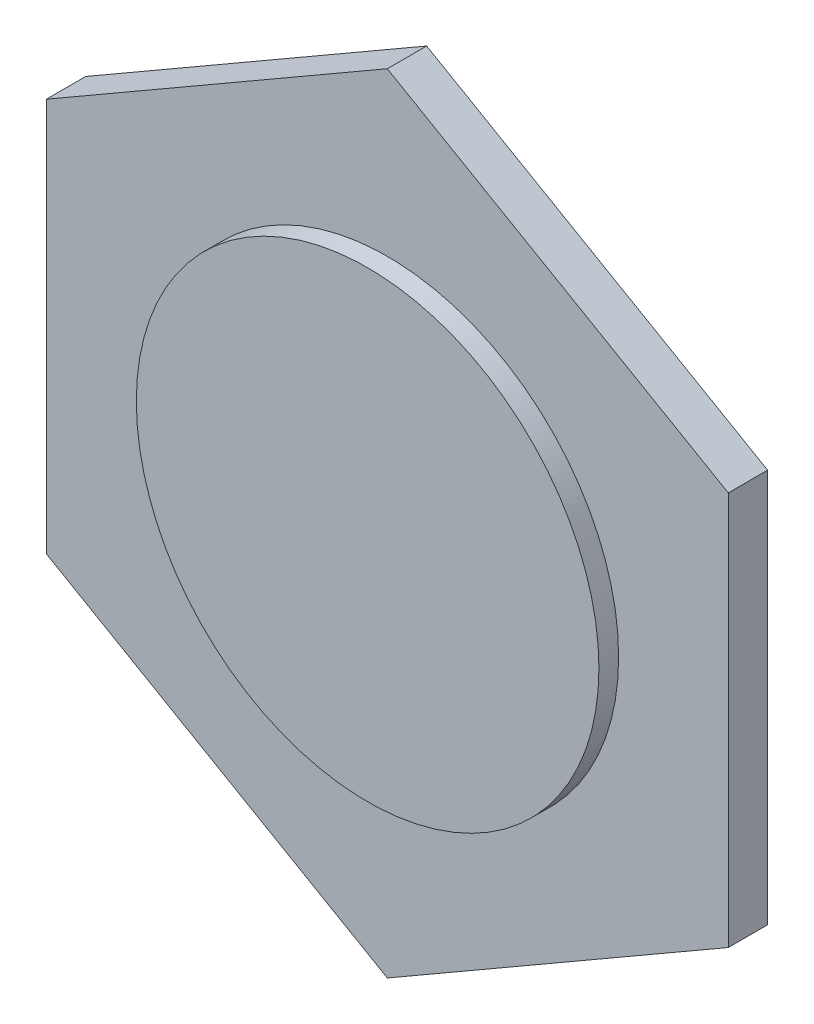
ISO-10303-21;
HEADER;
FILE_DESCRIPTION(('STEP AP214'),'2;1');
FILE_NAME('part.step','',(''),(''),'','','');
FILE_SCHEMA(('AUTOMOTIVE_DESIGN { 1 0 10303 214 1 1 1 1 }'));
ENDSEC;
DATA;
#1=APPLICATION_CONTEXT('core data for automotive mechanical design processes');
#2=APPLICATION_PROTOCOL_DEFINITION('international standard','automotive_design',2000,#1);
#3=PRODUCT_CONTEXT('',#1,'mechanical');
#4=PRODUCT('Part','Part','',(#3));
#5=PRODUCT_RELATED_PRODUCT_CATEGORY('part','',(#4));
#6=PRODUCT_DEFINITION_FORMATION('','',#4);
#7=PRODUCT_DEFINITION_CONTEXT('part definition',#1,'design');
#8=PRODUCT_DEFINITION('design','',#6,#7);
#9=PRODUCT_DEFINITION_SHAPE('','',#8);
#10=(LENGTH_UNIT() NAMED_UNIT(*) SI_UNIT(.MILLI.,.METRE.));
#11=(NAMED_UNIT(*) PLANE_ANGLE_UNIT() SI_UNIT($,.RADIAN.));
#12=(NAMED_UNIT(*) SI_UNIT($,.STERADIAN.) SOLID_ANGLE_UNIT());
#13=UNCERTAINTY_MEASURE_WITH_UNIT(LENGTH_MEASURE(1.E-05),#10,'distance_accuracy_value','');
#14=(GEOMETRIC_REPRESENTATION_CONTEXT(3) GLOBAL_UNCERTAINTY_ASSIGNED_CONTEXT((#13)) GLOBAL_UNIT_ASSIGNED_CONTEXT((#10,
#11,#12)) REPRESENTATION_CONTEXT('',''));
#15=CARTESIAN_POINT('',(0.,0.,0.));
#16=DIRECTION('',(0.,0.,1.));
#17=DIRECTION('',(1.,0.,0.));
#18=AXIS2_PLACEMENT_3D('',#15,#16,#17);
#19=CARTESIAN_POINT('',(0.,0.,4.));
#20=DIRECTION('',(0.,0.,1.));
#21=DIRECTION('',(1.,0.,0.));
#22=AXIS2_PLACEMENT_3D('',#19,#20,#21);
#23=PLANE('',#22);
#24=DIRECTION('',(0.,1.,0.));
#25=VECTOR('',#24,1.);
#26=CARTESIAN_POINT('',(34.6410161513776,-20.,4.));
#27=LINE('',#26,#25);
#28=CARTESIAN_POINT('',(34.6410161513776,-20.,4.));
#29=VERTEX_POINT('',#28);
#30=CARTESIAN_POINT('',(34.6410161513775,20.,4.));
#31=VERTEX_POINT('',#30);
#32=EDGE_CURVE('E130',#29,#31,#27,.T.);
#33=ORIENTED_EDGE('',*,*,#32,.T.);
#34=DIRECTION('',(-0.866025403784439,0.5,0.));
#35=VECTOR('',#34,1.);
#36=CARTESIAN_POINT('',(34.6410161513775,20.,4.));
#37=LINE('',#36,#35);
#38=CARTESIAN_POINT('',(0.,40.,4.));
#39=VERTEX_POINT('',#38);
#40=EDGE_CURVE('E88',#31,#39,#37,.T.);
#41=ORIENTED_EDGE('',*,*,#40,.T.);
#42=DIRECTION('',(-0.866025403784438,-0.500000000000001,0.));
#43=VECTOR('',#42,1.);
#44=CARTESIAN_POINT('',(0.,40.,4.));
#45=LINE('',#44,#43);
#46=CARTESIAN_POINT('',(-34.6410161513776,20.,4.));
#47=VERTEX_POINT('',#46);
#48=EDGE_CURVE('E101',#39,#47,#45,.T.);
#49=ORIENTED_EDGE('',*,*,#48,.T.);
#50=DIRECTION('',(0.,-1.,0.));
#51=VECTOR('',#50,1.);
#52=CARTESIAN_POINT('',(-34.6410161513776,20.,4.));
#53=LINE('',#52,#51);
#54=CARTESIAN_POINT('',(-34.6410161513775,-20.,4.));
#55=VERTEX_POINT('',#54);
#56=EDGE_CURVE('E95',#47,#55,#53,.T.);
#57=ORIENTED_EDGE('',*,*,#56,.T.);
#58=DIRECTION('',(0.866025403784439,-0.5,0.));
#59=VECTOR('',#58,1.);
#60=CARTESIAN_POINT('',(-34.6410161513775,-20.,4.));
#61=LINE('',#60,#59);
#62=CARTESIAN_POINT('',(0.,-40.,4.));
#63=VERTEX_POINT('',#62);
#64=EDGE_CURVE('E99',#55,#63,#61,.T.);
#65=ORIENTED_EDGE('',*,*,#64,.T.);
#66=DIRECTION('',(0.866025403784438,0.5,0.));
#67=VECTOR('',#66,1.);
#68=CARTESIAN_POINT('',(0.,-40.,4.));
#69=LINE('',#68,#67);
#70=EDGE_CURVE('E51',#63,#29,#69,.T.);
#71=ORIENTED_EDGE('',*,*,#70,.T.);
#72=EDGE_LOOP('',(#33,#41,#49,#57,#65,#71));
#73=FACE_BOUND('',#72,.T.);
#74=CARTESIAN_POINT('',(0.,0.,4.));
#75=DIRECTION('',(0.,0.,1.));
#76=DIRECTION('',(1.,0.,0.));
#77=AXIS2_PLACEMENT_3D('',#74,#75,#76);
#78=CIRCLE('',#77,23.5);
#79=CARTESIAN_POINT('',(23.5,0.,4.));
#80=VERTEX_POINT('',#79);
#81=EDGE_CURVE('E123',#80,#80,#78,.T.);
#82=ORIENTED_EDGE('',*,*,#81,.F.);
#83=EDGE_LOOP('',(#82));
#84=FACE_BOUND('',#83,.T.);
#85=ADVANCED_FACE('F34',(#73,#84),#23,.T.);
#86=CARTESIAN_POINT('',(0.,0.,0.));
#87=DIRECTION('',(0.,0.,1.));
#88=DIRECTION('',(1.,0.,0.));
#89=AXIS2_PLACEMENT_3D('',#86,#87,#88);
#90=PLANE('',#89);
#91=DIRECTION('',(0.,1.,0.));
#92=VECTOR('',#91,1.);
#93=CARTESIAN_POINT('',(34.6410161513776,-20.,0.));
#94=LINE('',#93,#92);
#95=CARTESIAN_POINT('',(34.6410161513776,-20.,0.));
#96=VERTEX_POINT('',#95);
#97=CARTESIAN_POINT('',(34.6410161513775,20.,0.));
#98=VERTEX_POINT('',#97);
#99=EDGE_CURVE('E119',#96,#98,#94,.T.);
#100=ORIENTED_EDGE('',*,*,#99,.F.);
#101=DIRECTION('',(0.866025403784438,0.5,0.));
#102=VECTOR('',#101,1.);
#103=CARTESIAN_POINT('',(0.,-40.,0.));
#104=LINE('',#103,#102);
#105=CARTESIAN_POINT('',(0.,-40.,0.));
#106=VERTEX_POINT('',#105);
#107=EDGE_CURVE('E80',#106,#96,#104,.T.);
#108=ORIENTED_EDGE('',*,*,#107,.F.);
#109=DIRECTION('',(0.866025403784439,-0.5,0.));
#110=VECTOR('',#109,1.);
#111=CARTESIAN_POINT('',(-34.6410161513775,-20.,0.));
#112=LINE('',#111,#110);
#113=CARTESIAN_POINT('',(-34.6410161513775,-20.,0.));
#114=VERTEX_POINT('',#113);
#115=EDGE_CURVE('E74',#114,#106,#112,.T.);
#116=ORIENTED_EDGE('',*,*,#115,.F.);
#117=DIRECTION('',(0.,-1.,0.));
#118=VECTOR('',#117,1.);
#119=CARTESIAN_POINT('',(-34.6410161513776,20.,0.));
#120=LINE('',#119,#118);
#121=CARTESIAN_POINT('',(-34.6410161513776,20.,0.));
#122=VERTEX_POINT('',#121);
#123=EDGE_CURVE('E109',#122,#114,#120,.T.);
#124=ORIENTED_EDGE('',*,*,#123,.F.);
#125=DIRECTION('',(-0.866025403784438,-0.500000000000001,0.));
#126=VECTOR('',#125,1.);
#127=CARTESIAN_POINT('',(0.,40.,0.));
#128=LINE('',#127,#126);
#129=CARTESIAN_POINT('',(0.,40.,0.));
#130=VERTEX_POINT('',#129);
#131=EDGE_CURVE('E125',#130,#122,#128,.T.);
#132=ORIENTED_EDGE('',*,*,#131,.F.);
#133=DIRECTION('',(-0.866025403784439,0.5,0.));
#134=VECTOR('',#133,1.);
#135=CARTESIAN_POINT('',(34.6410161513775,20.,0.));
#136=LINE('',#135,#134);
#137=EDGE_CURVE('E122',#98,#130,#136,.T.);
#138=ORIENTED_EDGE('',*,*,#137,.F.);
#139=EDGE_LOOP('',(#100,#108,#116,#124,#132,#138));
#140=FACE_BOUND('',#139,.T.);
#141=ADVANCED_FACE('F139',(#140),#90,.F.);
#142=CARTESIAN_POINT('',(34.6410161513776,-20.,4.));
#143=DIRECTION('',(-1.,0.,0.));
#144=DIRECTION('',(0.,-1.,0.));
#145=AXIS2_PLACEMENT_3D('',#142,#143,#144);
#146=PLANE('',#145);
#147=ORIENTED_EDGE('',*,*,#99,.T.);
#148=DIRECTION('',(0.,0.,-1.));
#149=VECTOR('',#148,1.);
#150=CARTESIAN_POINT('',(34.6410161513775,20.,4.));
#151=LINE('',#150,#149);
#152=EDGE_CURVE('E11',#31,#98,#151,.T.);
#153=ORIENTED_EDGE('',*,*,#152,.F.);
#154=ORIENTED_EDGE('',*,*,#32,.F.);
#155=DIRECTION('',(0.,0.,-1.));
#156=VECTOR('',#155,1.);
#157=CARTESIAN_POINT('',(34.6410161513776,-20.,4.));
#158=LINE('',#157,#156);
#159=EDGE_CURVE('E115',#29,#96,#158,.T.);
#160=ORIENTED_EDGE('',*,*,#159,.T.);
#161=EDGE_LOOP('',(#147,#153,#154,#160));
#162=FACE_BOUND('',#161,.T.);
#163=ADVANCED_FACE('F36',(#162),#146,.F.);
#164=CARTESIAN_POINT('',(34.6410161513775,20.,4.));
#165=DIRECTION('',(-0.5,-0.866025403784439,0.));
#166=DIRECTION('',(0.866025403784439,-0.5,0.));
#167=AXIS2_PLACEMENT_3D('',#164,#165,#166);
#168=PLANE('',#167);
#169=ORIENTED_EDGE('',*,*,#137,.T.);
#170=DIRECTION('',(0.,0.,-1.));
#171=VECTOR('',#170,1.);
#172=CARTESIAN_POINT('',(0.,40.,4.));
#173=LINE('',#172,#171);
#174=EDGE_CURVE('E43',#39,#130,#173,.T.);
#175=ORIENTED_EDGE('',*,*,#174,.F.);
#176=ORIENTED_EDGE('',*,*,#40,.F.);
#177=ORIENTED_EDGE('',*,*,#152,.T.);
#178=EDGE_LOOP('',(#169,#175,#176,#177));
#179=FACE_BOUND('',#178,.T.);
#180=ADVANCED_FACE('F215',(#179),#168,.F.);
#181=CARTESIAN_POINT('',(0.,40.,4.));
#182=DIRECTION('',(0.500000000000001,-0.866025403784438,0.));
#183=DIRECTION('',(0.866025403784438,0.500000000000001,0.));
#184=AXIS2_PLACEMENT_3D('',#181,#182,#183);
#185=PLANE('',#184);
#186=ORIENTED_EDGE('',*,*,#131,.T.);
#187=DIRECTION('',(0.,0.,-1.));
#188=VECTOR('',#187,1.);
#189=CARTESIAN_POINT('',(-34.6410161513776,20.,4.));
#190=LINE('',#189,#188);
#191=EDGE_CURVE('E110',#47,#122,#190,.T.);
#192=ORIENTED_EDGE('',*,*,#191,.F.);
#193=ORIENTED_EDGE('',*,*,#48,.F.);
#194=ORIENTED_EDGE('',*,*,#174,.T.);
#195=EDGE_LOOP('',(#186,#192,#193,#194));
#196=FACE_BOUND('',#195,.T.);
#197=ADVANCED_FACE('F136',(#196),#185,.F.);
#198=CARTESIAN_POINT('',(-34.6410161513776,20.,4.));
#199=DIRECTION('',(1.,0.,0.));
#200=DIRECTION('',(0.,1.,0.));
#201=AXIS2_PLACEMENT_3D('',#198,#199,#200);
#202=PLANE('',#201);
#203=ORIENTED_EDGE('',*,*,#123,.T.);
#204=DIRECTION('',(0.,0.,-1.));
#205=VECTOR('',#204,1.);
#206=CARTESIAN_POINT('',(-34.6410161513775,-20.,4.));
#207=LINE('',#206,#205);
#208=EDGE_CURVE('E106',#55,#114,#207,.T.);
#209=ORIENTED_EDGE('',*,*,#208,.F.);
#210=ORIENTED_EDGE('',*,*,#56,.F.);
#211=ORIENTED_EDGE('',*,*,#191,.T.);
#212=EDGE_LOOP('',(#203,#209,#210,#211));
#213=FACE_BOUND('',#212,.T.);
#214=ADVANCED_FACE('F107',(#213),#202,.F.);
#215=CARTESIAN_POINT('',(-34.6410161513775,-20.,4.));
#216=DIRECTION('',(0.5,0.866025403784439,0.));
#217=DIRECTION('',(-0.866025403784439,0.5,0.));
#218=AXIS2_PLACEMENT_3D('',#215,#216,#217);
#219=PLANE('',#218);
#220=ORIENTED_EDGE('',*,*,#115,.T.);
#221=DIRECTION('',(0.,0.,-1.));
#222=VECTOR('',#221,1.);
#223=CARTESIAN_POINT('',(0.,-40.,4.));
#224=LINE('',#223,#222);
#225=EDGE_CURVE('E111',#63,#106,#224,.T.);
#226=ORIENTED_EDGE('',*,*,#225,.F.);
#227=ORIENTED_EDGE('',*,*,#64,.F.);
#228=ORIENTED_EDGE('',*,*,#208,.T.);
#229=EDGE_LOOP('',(#220,#226,#227,#228));
#230=FACE_BOUND('',#229,.T.);
#231=ADVANCED_FACE('F113',(#230),#219,.F.);
#232=CARTESIAN_POINT('',(0.,-40.,4.));
#233=DIRECTION('',(-0.5,0.866025403784438,0.));
#234=DIRECTION('',(-0.866025403784438,-0.5,0.));
#235=AXIS2_PLACEMENT_3D('',#232,#233,#234);
#236=PLANE('',#235);
#237=ORIENTED_EDGE('',*,*,#107,.T.);
#238=ORIENTED_EDGE('',*,*,#159,.F.);
#239=ORIENTED_EDGE('',*,*,#70,.F.);
#240=ORIENTED_EDGE('',*,*,#225,.T.);
#241=EDGE_LOOP('',(#237,#238,#239,#240));
#242=FACE_BOUND('',#241,.T.);
#243=ADVANCED_FACE('F143',(#242),#236,.F.);
#244=CARTESIAN_POINT('',(0.,0.,6.));
#245=DIRECTION('',(0.,0.,-1.));
#246=DIRECTION('',(-1.,0.,0.));
#247=AXIS2_PLACEMENT_3D('',#244,#245,#246);
#248=CYLINDRICAL_SURFACE('',#247,23.5);
#249=ORIENTED_EDGE('',*,*,#81,.T.);
#250=EDGE_LOOP('',(#249));
#251=FACE_BOUND('',#250,.T.);
#252=CARTESIAN_POINT('',(0.,0.,6.));
#253=DIRECTION('',(0.,0.,1.));
#254=DIRECTION('',(1.,0.,0.));
#255=AXIS2_PLACEMENT_3D('',#252,#253,#254);
#256=CIRCLE('',#255,23.5);
#257=CARTESIAN_POINT('',(23.5,0.,6.));
#258=VERTEX_POINT('',#257);
#259=EDGE_CURVE('E168',#258,#258,#256,.T.);
#260=ORIENTED_EDGE('',*,*,#259,.F.);
#261=EDGE_LOOP('',(#260));
#262=FACE_BOUND('',#261,.T.);
#263=ADVANCED_FACE('F145',(#251,#262),#248,.T.);
#264=CARTESIAN_POINT('',(0.,0.,6.));
#265=DIRECTION('',(0.,0.,1.));
#266=DIRECTION('',(1.,0.,0.));
#267=AXIS2_PLACEMENT_3D('',#264,#265,#266);
#268=PLANE('',#267);
#269=ORIENTED_EDGE('',*,*,#259,.T.);
#270=EDGE_LOOP('',(#269));
#271=FACE_BOUND('',#270,.T.);
#272=ADVANCED_FACE('F151',(#271),#268,.T.);
#273=CLOSED_SHELL('',(#85,#141,#163,#180,#197,#214,#231,#243,#263,#272));
#274=MANIFOLD_SOLID_BREP('B2',#273);
#275=ADVANCED_BREP_SHAPE_REPRESENTATION('',(#18,#274),#14);
#276=SHAPE_DEFINITION_REPRESENTATION(#9,#275);
ENDSEC;
END-ISO-10303-21;
